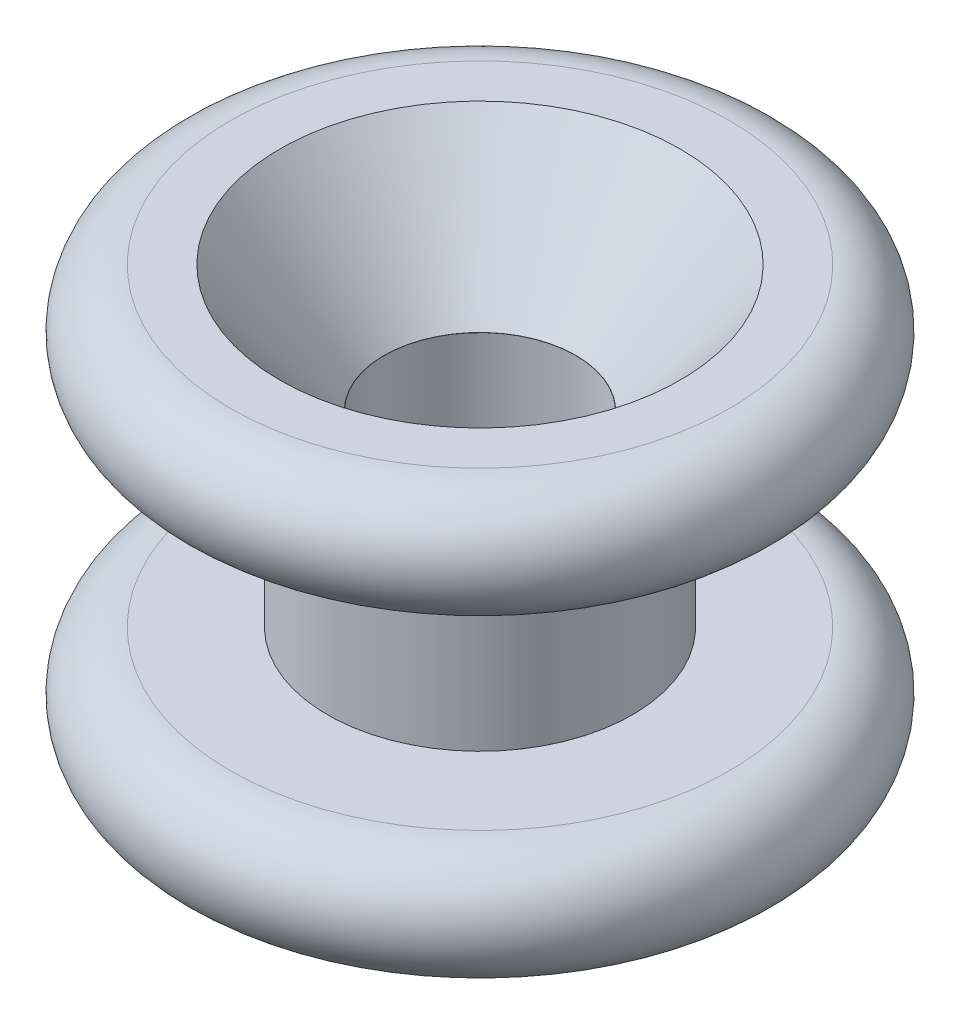
ISO-10303-21;
HEADER;
FILE_DESCRIPTION(('STEP AP214'),'2;1');
FILE_NAME('part.step','',(''),(''),'','','');
FILE_SCHEMA(('AUTOMOTIVE_DESIGN { 1 0 10303 214 1 1 1 1 }'));
ENDSEC;
DATA;
#1=APPLICATION_CONTEXT('core data for automotive mechanical design processes');
#2=APPLICATION_PROTOCOL_DEFINITION('international standard','automotive_design',2000,#1);
#3=PRODUCT_CONTEXT('',#1,'mechanical');
#4=PRODUCT('Part','Part','',(#3));
#5=PRODUCT_RELATED_PRODUCT_CATEGORY('part','',(#4));
#6=PRODUCT_DEFINITION_FORMATION('','',#4);
#7=PRODUCT_DEFINITION_CONTEXT('part definition',#1,'design');
#8=PRODUCT_DEFINITION('design','',#6,#7);
#9=PRODUCT_DEFINITION_SHAPE('','',#8);
#10=(LENGTH_UNIT() NAMED_UNIT(*) SI_UNIT(.MILLI.,.METRE.));
#11=(NAMED_UNIT(*) PLANE_ANGLE_UNIT() SI_UNIT($,.RADIAN.));
#12=(NAMED_UNIT(*) SI_UNIT($,.STERADIAN.) SOLID_ANGLE_UNIT());
#13=UNCERTAINTY_MEASURE_WITH_UNIT(LENGTH_MEASURE(1.E-05),#10,'distance_accuracy_value','');
#14=(GEOMETRIC_REPRESENTATION_CONTEXT(3) GLOBAL_UNCERTAINTY_ASSIGNED_CONTEXT((#13)) GLOBAL_UNIT_ASSIGNED_CONTEXT((#10,
#11,#12)) REPRESENTATION_CONTEXT('',''));
#15=CARTESIAN_POINT('',(0.,0.,0.));
#16=DIRECTION('',(0.,0.,1.));
#17=DIRECTION('',(1.,0.,0.));
#18=AXIS2_PLACEMENT_3D('',#15,#16,#17);
#19=CARTESIAN_POINT('',(0.,0.,0.));
#20=DIRECTION('',(0.,-1.,0.));
#21=DIRECTION('',(0.,0.,-1.));
#22=AXIS2_PLACEMENT_3D('',#19,#20,#21);
#23=CYLINDRICAL_SURFACE('',#22,2.4967819);
#24=CARTESIAN_POINT('',(0.,2.286,0.));
#25=DIRECTION('',(0.,-1.,0.));
#26=DIRECTION('',(0.,0.,-1.));
#27=AXIS2_PLACEMENT_3D('',#24,#25,#26);
#28=CIRCLE('',#27,2.4967819);
#29=CARTESIAN_POINT('',(0.,2.286,-2.4967819));
#30=VERTEX_POINT('',#29);
#31=EDGE_CURVE('E40',#30,#30,#28,.F.);
#32=ORIENTED_EDGE('',*,*,#31,.T.);
#33=EDGE_LOOP('',(#32));
#34=FACE_BOUND('',#33,.T.);
#35=CARTESIAN_POINT('',(0.,-5.588,0.));
#36=DIRECTION('',(0.,-1.,0.));
#37=DIRECTION('',(0.,0.,-1.));
#38=AXIS2_PLACEMENT_3D('',#35,#36,#37);
#39=CIRCLE('',#38,2.4967819);
#40=CARTESIAN_POINT('',(0.,-5.588,-2.4967819));
#41=VERTEX_POINT('',#40);
#42=EDGE_CURVE('E62',#41,#41,#39,.T.);
#43=ORIENTED_EDGE('',*,*,#42,.T.);
#44=EDGE_LOOP('',(#43));
#45=FACE_BOUND('',#44,.T.);
#46=ADVANCED_FACE('F37',(#34,#45),#23,.F.);
#47=CARTESIAN_POINT('',(2.4967819,5.588,0.));
#48=DIRECTION('',(0.,-1.,0.));
#49=DIRECTION('',(0.,0.,-1.));
#50=AXIS2_PLACEMENT_3D('',#47,#48,#49);
#51=PLANE('',#50);
#52=CARTESIAN_POINT('',(0.,5.588,0.));
#53=DIRECTION('',(0.,-1.,0.));
#54=DIRECTION('',(0.,0.,-1.));
#55=AXIS2_PLACEMENT_3D('',#52,#53,#54);
#56=CIRCLE('',#55,5.2197);
#57=CARTESIAN_POINT('',(0.,5.588,-5.2197));
#58=VERTEX_POINT('',#57);
#59=EDGE_CURVE('E65',#58,#58,#56,.T.);
#60=ORIENTED_EDGE('',*,*,#59,.T.);
#61=EDGE_LOOP('',(#60));
#62=FACE_BOUND('',#61,.T.);
#63=CARTESIAN_POINT('',(0.,5.588,0.));
#64=DIRECTION('',(0.,-1.,0.));
#65=DIRECTION('',(0.,0.,-1.));
#66=AXIS2_PLACEMENT_3D('',#63,#64,#65);
#67=CIRCLE('',#66,6.5024);
#68=CARTESIAN_POINT('',(0.,5.588,-6.5024));
#69=VERTEX_POINT('',#68);
#70=EDGE_CURVE('E10',#69,#69,#67,.T.);
#71=ORIENTED_EDGE('',*,*,#70,.F.);
#72=EDGE_LOOP('',(#71));
#73=FACE_BOUND('',#72,.T.);
#74=ADVANCED_FACE('F84',(#62,#73),#51,.F.);
#75=CARTESIAN_POINT('',(0.,4.0894,0.));
#76=DIRECTION('',(0.,-1.,0.));
#77=DIRECTION('',(0.,0.,-1.));
#78=AXIS2_PLACEMENT_3D('',#75,#76,#77);
#79=TOROIDAL_SURFACE('',#78,6.5024,1.4986);
#80=CARTESIAN_POINT('',(0.,2.5908,0.));
#81=DIRECTION('',(0.,-1.,0.));
#82=DIRECTION('',(0.,0.,-1.));
#83=AXIS2_PLACEMENT_3D('',#80,#81,#82);
#84=CIRCLE('',#83,6.5024);
#85=CARTESIAN_POINT('',(0.,2.5908,-6.5024));
#86=VERTEX_POINT('',#85);
#87=EDGE_CURVE('E44',#86,#86,#84,.T.);
#88=ORIENTED_EDGE('',*,*,#87,.F.);
#89=EDGE_LOOP('',(#88));
#90=FACE_BOUND('',#89,.T.);
#91=ORIENTED_EDGE('',*,*,#70,.T.);
#92=EDGE_LOOP('',(#91));
#93=FACE_BOUND('',#92,.T.);
#94=ADVANCED_FACE('F109',(#90,#93),#79,.T.);
#95=CARTESIAN_POINT('',(6.5024,2.5908,0.));
#96=DIRECTION('',(0.,1.,0.));
#97=DIRECTION('',(0.,0.,1.));
#98=AXIS2_PLACEMENT_3D('',#95,#96,#97);
#99=PLANE('',#98);
#100=CARTESIAN_POINT('',(0.,2.5908,0.));
#101=DIRECTION('',(0.,-1.,0.));
#102=DIRECTION('',(0.,0.,-1.));
#103=AXIS2_PLACEMENT_3D('',#100,#101,#102);
#104=CIRCLE('',#103,3.9751);
#105=CARTESIAN_POINT('',(0.,2.5908,-3.9751));
#106=VERTEX_POINT('',#105);
#107=EDGE_CURVE('E48',#106,#106,#104,.T.);
#108=ORIENTED_EDGE('',*,*,#107,.F.);
#109=EDGE_LOOP('',(#108));
#110=FACE_BOUND('',#109,.T.);
#111=ORIENTED_EDGE('',*,*,#87,.T.);
#112=EDGE_LOOP('',(#111));
#113=FACE_BOUND('',#112,.T.);
#114=ADVANCED_FACE('F105',(#110,#113),#99,.F.);
#115=CARTESIAN_POINT('',(0.,0.,0.));
#116=DIRECTION('',(0.,-1.,0.));
#117=DIRECTION('',(0.,0.,-1.));
#118=AXIS2_PLACEMENT_3D('',#115,#116,#117);
#119=CYLINDRICAL_SURFACE('',#118,3.9751);
#120=CARTESIAN_POINT('',(0.,-2.5908,0.));
#121=DIRECTION('',(0.,-1.,0.));
#122=DIRECTION('',(0.,0.,-1.));
#123=AXIS2_PLACEMENT_3D('',#120,#121,#122);
#124=CIRCLE('',#123,3.9751);
#125=CARTESIAN_POINT('',(0.,-2.5908,-3.9751));
#126=VERTEX_POINT('',#125);
#127=EDGE_CURVE('E53',#126,#126,#124,.T.);
#128=ORIENTED_EDGE('',*,*,#127,.F.);
#129=EDGE_LOOP('',(#128));
#130=FACE_BOUND('',#129,.T.);
#131=ORIENTED_EDGE('',*,*,#107,.T.);
#132=EDGE_LOOP('',(#131));
#133=FACE_BOUND('',#132,.T.);
#134=ADVANCED_FACE('F101',(#130,#133),#119,.T.);
#135=CARTESIAN_POINT('',(6.5024,-2.5908,0.));
#136=DIRECTION('',(0.,1.,0.));
#137=DIRECTION('',(0.,0.,1.));
#138=AXIS2_PLACEMENT_3D('',#135,#136,#137);
#139=PLANE('',#138);
#140=ORIENTED_EDGE('',*,*,#127,.T.);
#141=EDGE_LOOP('',(#140));
#142=FACE_BOUND('',#141,.T.);
#143=CARTESIAN_POINT('',(0.,-2.5908,0.));
#144=DIRECTION('',(0.,-1.,0.));
#145=DIRECTION('',(0.,0.,-1.));
#146=AXIS2_PLACEMENT_3D('',#143,#144,#145);
#147=CIRCLE('',#146,6.5024);
#148=CARTESIAN_POINT('',(0.,-2.5908,-6.5024));
#149=VERTEX_POINT('',#148);
#150=EDGE_CURVE('E56',#149,#149,#147,.T.);
#151=ORIENTED_EDGE('',*,*,#150,.F.);
#152=EDGE_LOOP('',(#151));
#153=FACE_BOUND('',#152,.T.);
#154=ADVANCED_FACE('F94',(#142,#153),#139,.T.);
#155=CARTESIAN_POINT('',(0.,-4.0894,0.));
#156=DIRECTION('',(0.,-1.,0.));
#157=DIRECTION('',(0.,0.,-1.));
#158=AXIS2_PLACEMENT_3D('',#155,#156,#157);
#159=TOROIDAL_SURFACE('',#158,6.5024,1.4986);
#160=ORIENTED_EDGE('',*,*,#150,.T.);
#161=EDGE_LOOP('',(#160));
#162=FACE_BOUND('',#161,.T.);
#163=CARTESIAN_POINT('',(0.,-5.588,0.));
#164=DIRECTION('',(0.,-1.,0.));
#165=DIRECTION('',(0.,0.,-1.));
#166=AXIS2_PLACEMENT_3D('',#163,#164,#165);
#167=CIRCLE('',#166,6.5024);
#168=CARTESIAN_POINT('',(0.,-5.588,-6.5024));
#169=VERTEX_POINT('',#168);
#170=EDGE_CURVE('E59',#169,#169,#167,.T.);
#171=ORIENTED_EDGE('',*,*,#170,.F.);
#172=EDGE_LOOP('',(#171));
#173=FACE_BOUND('',#172,.T.);
#174=ADVANCED_FACE('F88',(#162,#173),#159,.T.);
#175=CARTESIAN_POINT('',(2.4967819,-5.588,0.));
#176=DIRECTION('',(0.,-1.,0.));
#177=DIRECTION('',(0.,0.,-1.));
#178=AXIS2_PLACEMENT_3D('',#175,#176,#177);
#179=PLANE('',#178);
#180=ORIENTED_EDGE('',*,*,#170,.T.);
#181=EDGE_LOOP('',(#180));
#182=FACE_BOUND('',#181,.T.);
#183=ORIENTED_EDGE('',*,*,#42,.F.);
#184=EDGE_LOOP('',(#183));
#185=FACE_BOUND('',#184,.T.);
#186=ADVANCED_FACE('F77',(#182,#185),#179,.T.);
#187=CARTESIAN_POINT('',(2.5019,2.286,0.));
#188=DIRECTION('',(0.,-1.,0.));
#189=DIRECTION('',(0.,0.,-1.));
#190=AXIS2_PLACEMENT_3D('',#187,#188,#189);
#191=PLANE('',#190);
#192=CARTESIAN_POINT('',(0.,2.286,0.));
#193=DIRECTION('',(0.,-1.,0.));
#194=DIRECTION('',(0.,0.,-1.));
#195=AXIS2_PLACEMENT_3D('',#192,#193,#194);
#196=CIRCLE('',#195,2.5019);
#197=CARTESIAN_POINT('',(0.,2.286,-2.5019));
#198=VERTEX_POINT('',#197);
#199=EDGE_CURVE('E68',#198,#198,#196,.T.);
#200=ORIENTED_EDGE('',*,*,#199,.F.);
#201=EDGE_LOOP('',(#200));
#202=FACE_BOUND('',#201,.T.);
#203=ORIENTED_EDGE('',*,*,#31,.F.);
#204=EDGE_LOOP('',(#203));
#205=FACE_BOUND('',#204,.T.);
#206=ADVANCED_FACE('F74',(#202,#205),#191,.F.);
#207=CARTESIAN_POINT('',(0.,2.286,0.));
#208=DIRECTION('',(0.,1.,0.));
#209=DIRECTION('',(0.,0.,1.));
#210=AXIS2_PLACEMENT_3D('',#207,#208,#209);
#211=CONICAL_SURFACE('',#210,2.5019,0.688654701058509);
#212=ORIENTED_EDGE('',*,*,#59,.F.);
#213=EDGE_LOOP('',(#212));
#214=FACE_BOUND('',#213,.T.);
#215=ORIENTED_EDGE('',*,*,#199,.T.);
#216=EDGE_LOOP('',(#215));
#217=FACE_BOUND('',#216,.T.);
#218=ADVANCED_FACE('F72',(#214,#217),#211,.F.);
#219=CLOSED_SHELL('',(#46,#74,#94,#114,#134,#154,#174,#186,#206,#218));
#220=MANIFOLD_SOLID_BREP('B2',#219);
#221=ADVANCED_BREP_SHAPE_REPRESENTATION('',(#18,#220),#14);
#222=SHAPE_DEFINITION_REPRESENTATION(#9,#221);
ENDSEC;
END-ISO-10303-21;
